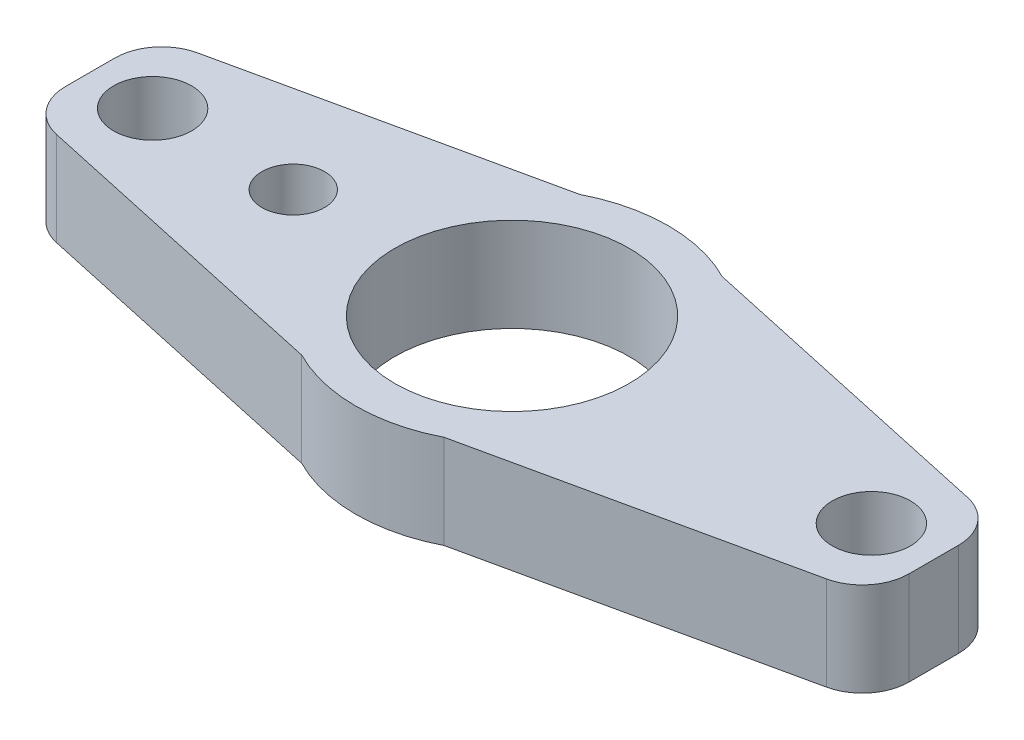
ISO-10303-21;
HEADER;
FILE_DESCRIPTION(('STEP AP214'),'2;1');
FILE_NAME('part.step','',(''),(''),'','','');
FILE_SCHEMA(('AUTOMOTIVE_DESIGN { 1 0 10303 214 1 1 1 1 }'));
ENDSEC;
DATA;
#1=APPLICATION_CONTEXT('core data for automotive mechanical design processes');
#2=APPLICATION_PROTOCOL_DEFINITION('international standard','automotive_design',2000,#1);
#3=PRODUCT_CONTEXT('',#1,'mechanical');
#4=PRODUCT('Part','Part','',(#3));
#5=PRODUCT_RELATED_PRODUCT_CATEGORY('part','',(#4));
#6=PRODUCT_DEFINITION_FORMATION('','',#4);
#7=PRODUCT_DEFINITION_CONTEXT('part definition',#1,'design');
#8=PRODUCT_DEFINITION('design','',#6,#7);
#9=PRODUCT_DEFINITION_SHAPE('','',#8);
#10=(LENGTH_UNIT() NAMED_UNIT(*) SI_UNIT(.MILLI.,.METRE.));
#11=(NAMED_UNIT(*) PLANE_ANGLE_UNIT() SI_UNIT($,.RADIAN.));
#12=(NAMED_UNIT(*) SI_UNIT($,.STERADIAN.) SOLID_ANGLE_UNIT());
#13=UNCERTAINTY_MEASURE_WITH_UNIT(LENGTH_MEASURE(1.E-05),#10,'distance_accuracy_value','');
#14=(GEOMETRIC_REPRESENTATION_CONTEXT(3) GLOBAL_UNCERTAINTY_ASSIGNED_CONTEXT((#13)) GLOBAL_UNIT_ASSIGNED_CONTEXT((#10,
#11,#12)) REPRESENTATION_CONTEXT('',''));
#15=CARTESIAN_POINT('',(0.,0.,0.));
#16=DIRECTION('',(0.,0.,1.));
#17=DIRECTION('',(1.,0.,0.));
#18=AXIS2_PLACEMENT_3D('',#15,#16,#17);
#19=CARTESIAN_POINT('',(0.,3.,0.));
#20=DIRECTION('',(0.,1.,0.));
#21=DIRECTION('',(0.,0.,1.));
#22=AXIS2_PLACEMENT_3D('',#19,#20,#21);
#23=PLANE('',#22);
#24=CARTESIAN_POINT('',(11.5,3.,0.));
#25=DIRECTION('',(0.,1.,0.));
#26=DIRECTION('',(0.,0.,-1.));
#27=AXIS2_PLACEMENT_3D('',#24,#25,#26);
#28=CIRCLE('',#27,1.25);
#29=CARTESIAN_POINT('',(11.5,3.,-1.25));
#30=VERTEX_POINT('',#29);
#31=EDGE_CURVE('E289',#30,#30,#28,.T.);
#32=ORIENTED_EDGE('',*,*,#31,.F.);
#33=EDGE_LOOP('',(#32));
#34=FACE_BOUND('',#33,.T.);
#35=CARTESIAN_POINT('',(0.,3.,0.));
#36=DIRECTION('',(0.,1.,0.));
#37=DIRECTION('',(0.,0.,1.));
#38=AXIS2_PLACEMENT_3D('',#35,#36,#37);
#39=CIRCLE('',#38,3.75);
#40=CARTESIAN_POINT('',(0.,3.,3.75));
#41=VERTEX_POINT('',#40);
#42=EDGE_CURVE('E261',#41,#41,#39,.T.);
#43=ORIENTED_EDGE('',*,*,#42,.F.);
#44=EDGE_LOOP('',(#43));
#45=FACE_BOUND('',#44,.T.);
#46=DIRECTION('',(0.976969831494084,0.,-0.213377478545465));
#47=VECTOR('',#46,1.);
#48=CARTESIAN_POINT('',(2.27784584109344,3.,4.45100194610307));
#49=LINE('',#48,#47);
#50=CARTESIAN_POINT('',(2.27784584109344,3.,4.45100194610307));
#51=VERTEX_POINT('',#50);
#52=CARTESIAN_POINT('',(12.3200662178182,3.,2.25770631515564));
#53=VERTEX_POINT('',#52);
#54=EDGE_CURVE('E129',#51,#53,#49,.T.);
#55=ORIENTED_EDGE('',*,*,#54,.T.);
#56=CARTESIAN_POINT('',(12.,3.,0.792251567914513));
#57=DIRECTION('',(0.,1.,0.));
#58=DIRECTION('',(0.,0.,1.));
#59=AXIS2_PLACEMENT_3D('',#56,#57,#58);
#60=CIRCLE('',#59,1.5);
#61=CARTESIAN_POINT('',(13.5,3.,0.792251567914513));
#62=VERTEX_POINT('',#61);
#63=EDGE_CURVE('E193',#53,#62,#60,.T.);
#64=ORIENTED_EDGE('',*,*,#63,.T.);
#65=DIRECTION('',(0.,0.,-1.));
#66=VECTOR('',#65,1.);
#67=CARTESIAN_POINT('',(13.5,3.,-2.));
#68=LINE('',#67,#66);
#69=CARTESIAN_POINT('',(13.5,3.,-0.792251567914513));
#70=VERTEX_POINT('',#69);
#71=EDGE_CURVE('E140',#62,#70,#68,.T.);
#72=ORIENTED_EDGE('',*,*,#71,.T.);
#73=CARTESIAN_POINT('',(12.,3.,-0.792251567914513));
#74=DIRECTION('',(0.,1.,0.));
#75=DIRECTION('',(0.,0.,1.));
#76=AXIS2_PLACEMENT_3D('',#73,#74,#75);
#77=CIRCLE('',#76,1.5);
#78=CARTESIAN_POINT('',(12.3200662178182,3.,-2.25770631515564));
#79=VERTEX_POINT('',#78);
#80=EDGE_CURVE('E190',#70,#79,#77,.T.);
#81=ORIENTED_EDGE('',*,*,#80,.T.);
#82=DIRECTION('',(-0.976969831494084,0.,-0.213377478545465));
#83=VECTOR('',#82,1.);
#84=CARTESIAN_POINT('',(2.27784584109344,3.,-4.45100194610307));
#85=LINE('',#84,#83);
#86=CARTESIAN_POINT('',(2.27784584109344,3.,-4.45100194610307));
#87=VERTEX_POINT('',#86);
#88=EDGE_CURVE('E271',#79,#87,#85,.T.);
#89=ORIENTED_EDGE('',*,*,#88,.T.);
#90=CARTESIAN_POINT('',(0.,3.,0.));
#91=DIRECTION('',(0.,1.,0.));
#92=DIRECTION('',(0.,0.,1.));
#93=AXIS2_PLACEMENT_3D('',#90,#91,#92);
#94=CIRCLE('',#93,5.);
#95=CARTESIAN_POINT('',(-2.27784584109346,3.,-4.45100194610306));
#96=VERTEX_POINT('',#95);
#97=EDGE_CURVE('E268',#87,#96,#94,.T.);
#98=ORIENTED_EDGE('',*,*,#97,.T.);
#99=DIRECTION('',(-0.976969831494084,0.,0.213377478545465));
#100=VECTOR('',#99,1.);
#101=CARTESIAN_POINT('',(-2.27784584109346,3.,-4.45100194610306));
#102=LINE('',#101,#100);
#103=CARTESIAN_POINT('',(-12.3200662178182,3.,-2.25770631515564));
#104=VERTEX_POINT('',#103);
#105=EDGE_CURVE('E242',#96,#104,#102,.T.);
#106=ORIENTED_EDGE('',*,*,#105,.T.);
#107=CARTESIAN_POINT('',(-12.,3.,-0.792251567914513));
#108=DIRECTION('',(0.,1.,0.));
#109=DIRECTION('',(0.,0.,1.));
#110=AXIS2_PLACEMENT_3D('',#107,#108,#109);
#111=CIRCLE('',#110,1.5);
#112=CARTESIAN_POINT('',(-13.5,3.,-0.792251567914513));
#113=VERTEX_POINT('',#112);
#114=EDGE_CURVE('E185',#104,#113,#111,.T.);
#115=ORIENTED_EDGE('',*,*,#114,.T.);
#116=DIRECTION('',(0.,0.,1.));
#117=VECTOR('',#116,1.);
#118=CARTESIAN_POINT('',(-13.5,3.,-2.));
#119=LINE('',#118,#117);
#120=CARTESIAN_POINT('',(-13.5,3.,0.792251567914513));
#121=VERTEX_POINT('',#120);
#122=EDGE_CURVE('E212',#113,#121,#119,.T.);
#123=ORIENTED_EDGE('',*,*,#122,.T.);
#124=CARTESIAN_POINT('',(-12.,3.,0.792251567914513));
#125=DIRECTION('',(0.,1.,0.));
#126=DIRECTION('',(0.,0.,1.));
#127=AXIS2_PLACEMENT_3D('',#124,#125,#126);
#128=CIRCLE('',#127,1.5);
#129=CARTESIAN_POINT('',(-12.3200662178182,3.,2.25770631515564));
#130=VERTEX_POINT('',#129);
#131=EDGE_CURVE('E55',#121,#130,#128,.T.);
#132=ORIENTED_EDGE('',*,*,#131,.T.);
#133=DIRECTION('',(0.976969831494084,0.,0.213377478545465));
#134=VECTOR('',#133,1.);
#135=CARTESIAN_POINT('',(-2.27784584109346,3.,4.45100194610306));
#136=LINE('',#135,#134);
#137=CARTESIAN_POINT('',(-2.27784584109346,3.,4.45100194610306));
#138=VERTEX_POINT('',#137);
#139=EDGE_CURVE('E145',#130,#138,#136,.T.);
#140=ORIENTED_EDGE('',*,*,#139,.T.);
#141=CARTESIAN_POINT('',(0.,3.,0.));
#142=DIRECTION('',(0.,1.,0.));
#143=DIRECTION('',(0.,0.,1.));
#144=AXIS2_PLACEMENT_3D('',#141,#142,#143);
#145=CIRCLE('',#144,5.);
#146=EDGE_CURVE('E141',#138,#51,#145,.T.);
#147=ORIENTED_EDGE('',*,*,#146,.T.);
#148=EDGE_LOOP('',(#55,#64,#72,#81,#89,#98,#106,#115,#123,#132,#140,#147));
#149=FACE_BOUND('',#148,.T.);
#150=CARTESIAN_POINT('',(-11.5,3.,0.));
#151=DIRECTION('',(0.,1.,0.));
#152=DIRECTION('',(0.,0.,1.));
#153=AXIS2_PLACEMENT_3D('',#150,#151,#152);
#154=CIRCLE('',#153,1.25);
#155=CARTESIAN_POINT('',(-11.5,3.,1.25));
#156=VERTEX_POINT('',#155);
#157=EDGE_CURVE('E281',#156,#156,#154,.T.);
#158=ORIENTED_EDGE('',*,*,#157,.F.);
#159=EDGE_LOOP('',(#158));
#160=FACE_BOUND('',#159,.T.);
#161=CARTESIAN_POINT('',(-7.,3.,0.));
#162=DIRECTION('',(0.,1.,0.));
#163=DIRECTION('',(0.,0.,1.));
#164=AXIS2_PLACEMENT_3D('',#161,#162,#163);
#165=CIRCLE('',#164,1.);
#166=CARTESIAN_POINT('',(-7.,3.,1.));
#167=VERTEX_POINT('',#166);
#168=EDGE_CURVE('E297',#167,#167,#165,.T.);
#169=ORIENTED_EDGE('',*,*,#168,.F.);
#170=EDGE_LOOP('',(#169));
#171=FACE_BOUND('',#170,.T.);
#172=ADVANCED_FACE('F39',(#34,#45,#149,#160,#171),#23,.T.);
#173=CARTESIAN_POINT('',(0.,0.,0.));
#174=DIRECTION('',(0.,1.,0.));
#175=DIRECTION('',(0.,0.,1.));
#176=AXIS2_PLACEMENT_3D('',#173,#174,#175);
#177=PLANE('',#176);
#178=DIRECTION('',(0.,0.,-1.));
#179=VECTOR('',#178,1.);
#180=CARTESIAN_POINT('',(13.5,0.,-2.));
#181=LINE('',#180,#179);
#182=CARTESIAN_POINT('',(13.5,0.,0.792251567914513));
#183=VERTEX_POINT('',#182);
#184=CARTESIAN_POINT('',(13.5,0.,-0.792251567914513));
#185=VERTEX_POINT('',#184);
#186=EDGE_CURVE('E250',#183,#185,#181,.T.);
#187=ORIENTED_EDGE('',*,*,#186,.F.);
#188=CARTESIAN_POINT('',(12.,0.,0.792251567914513));
#189=DIRECTION('',(0.,1.,0.));
#190=DIRECTION('',(0.,0.,1.));
#191=AXIS2_PLACEMENT_3D('',#188,#189,#190);
#192=CIRCLE('',#191,1.5);
#193=CARTESIAN_POINT('',(12.3200662178182,0.,2.25770631515564));
#194=VERTEX_POINT('',#193);
#195=EDGE_CURVE('E180',#183,#194,#192,.F.);
#196=ORIENTED_EDGE('',*,*,#195,.T.);
#197=DIRECTION('',(0.976969831494084,0.,-0.213377478545465));
#198=VECTOR('',#197,1.);
#199=CARTESIAN_POINT('',(2.27784584109344,0.,4.45100194610307));
#200=LINE('',#199,#198);
#201=CARTESIAN_POINT('',(2.27784584109344,0.,4.45100194610307));
#202=VERTEX_POINT('',#201);
#203=EDGE_CURVE('E256',#202,#194,#200,.T.);
#204=ORIENTED_EDGE('',*,*,#203,.F.);
#205=CARTESIAN_POINT('',(0.,0.,0.));
#206=DIRECTION('',(0.,1.,0.));
#207=DIRECTION('',(0.,0.,1.));
#208=AXIS2_PLACEMENT_3D('',#205,#206,#207);
#209=CIRCLE('',#208,5.);
#210=CARTESIAN_POINT('',(-2.27784584109346,0.,4.45100194610306));
#211=VERTEX_POINT('',#210);
#212=EDGE_CURVE('E154',#211,#202,#209,.T.);
#213=ORIENTED_EDGE('',*,*,#212,.F.);
#214=DIRECTION('',(0.976969831494084,0.,0.213377478545465));
#215=VECTOR('',#214,1.);
#216=CARTESIAN_POINT('',(-2.27784584109346,0.,4.45100194610306));
#217=LINE('',#216,#215);
#218=CARTESIAN_POINT('',(-12.3200662178182,0.,2.25770631515564));
#219=VERTEX_POINT('',#218);
#220=EDGE_CURVE('E150',#219,#211,#217,.T.);
#221=ORIENTED_EDGE('',*,*,#220,.F.);
#222=CARTESIAN_POINT('',(-12.,0.,0.792251567914513));
#223=DIRECTION('',(0.,1.,0.));
#224=DIRECTION('',(0.,0.,1.));
#225=AXIS2_PLACEMENT_3D('',#222,#223,#224);
#226=CIRCLE('',#225,1.5);
#227=CARTESIAN_POINT('',(-13.5,0.,0.792251567914513));
#228=VERTEX_POINT('',#227);
#229=EDGE_CURVE('E174',#219,#228,#226,.F.);
#230=ORIENTED_EDGE('',*,*,#229,.T.);
#231=DIRECTION('',(0.,0.,1.));
#232=VECTOR('',#231,1.);
#233=CARTESIAN_POINT('',(-13.5,0.,-2.));
#234=LINE('',#233,#232);
#235=CARTESIAN_POINT('',(-13.5,0.,-0.792251567914513));
#236=VERTEX_POINT('',#235);
#237=EDGE_CURVE('E211',#236,#228,#234,.T.);
#238=ORIENTED_EDGE('',*,*,#237,.F.);
#239=CARTESIAN_POINT('',(-12.,0.,-0.792251567914513));
#240=DIRECTION('',(0.,1.,0.));
#241=DIRECTION('',(0.,0.,1.));
#242=AXIS2_PLACEMENT_3D('',#239,#240,#241);
#243=CIRCLE('',#242,1.5);
#244=CARTESIAN_POINT('',(-12.3200662178182,0.,-2.25770631515564));
#245=VERTEX_POINT('',#244);
#246=EDGE_CURVE('E171',#236,#245,#243,.F.);
#247=ORIENTED_EDGE('',*,*,#246,.T.);
#248=DIRECTION('',(-0.976969831494084,0.,0.213377478545465));
#249=VECTOR('',#248,1.);
#250=CARTESIAN_POINT('',(-2.27784584109346,0.,-4.45100194610306));
#251=LINE('',#250,#249);
#252=CARTESIAN_POINT('',(-2.27784584109346,0.,-4.45100194610306));
#253=VERTEX_POINT('',#252);
#254=EDGE_CURVE('E223',#253,#245,#251,.T.);
#255=ORIENTED_EDGE('',*,*,#254,.F.);
#256=CARTESIAN_POINT('',(0.,0.,0.));
#257=DIRECTION('',(0.,1.,0.));
#258=DIRECTION('',(0.,0.,1.));
#259=AXIS2_PLACEMENT_3D('',#256,#257,#258);
#260=CIRCLE('',#259,5.);
#261=CARTESIAN_POINT('',(2.27784584109344,0.,-4.45100194610307));
#262=VERTEX_POINT('',#261);
#263=EDGE_CURVE('E228',#262,#253,#260,.T.);
#264=ORIENTED_EDGE('',*,*,#263,.F.);
#265=DIRECTION('',(-0.976969831494084,0.,-0.213377478545465));
#266=VECTOR('',#265,1.);
#267=CARTESIAN_POINT('',(2.27784584109344,0.,-4.45100194610307));
#268=LINE('',#267,#266);
#269=CARTESIAN_POINT('',(12.3200662178182,0.,-2.25770631515564));
#270=VERTEX_POINT('',#269);
#271=EDGE_CURVE('E247',#270,#262,#268,.T.);
#272=ORIENTED_EDGE('',*,*,#271,.F.);
#273=CARTESIAN_POINT('',(12.,0.,-0.792251567914513));
#274=DIRECTION('',(0.,1.,0.));
#275=DIRECTION('',(0.,0.,1.));
#276=AXIS2_PLACEMENT_3D('',#273,#274,#275);
#277=CIRCLE('',#276,1.5);
#278=EDGE_CURVE('E177',#270,#185,#277,.F.);
#279=ORIENTED_EDGE('',*,*,#278,.T.);
#280=EDGE_LOOP('',(#187,#196,#204,#213,#221,#230,#238,#247,#255,#264,#272,#279));
#281=FACE_BOUND('',#280,.T.);
#282=CARTESIAN_POINT('',(0.,0.,0.));
#283=DIRECTION('',(0.,1.,0.));
#284=DIRECTION('',(0.,0.,1.));
#285=AXIS2_PLACEMENT_3D('',#282,#283,#284);
#286=CIRCLE('',#285,3.75);
#287=CARTESIAN_POINT('',(0.,0.,3.75));
#288=VERTEX_POINT('',#287);
#289=EDGE_CURVE('E277',#288,#288,#286,.T.);
#290=ORIENTED_EDGE('',*,*,#289,.T.);
#291=EDGE_LOOP('',(#290));
#292=FACE_BOUND('',#291,.T.);
#293=CARTESIAN_POINT('',(-11.5,0.,0.));
#294=DIRECTION('',(0.,1.,0.));
#295=DIRECTION('',(0.,0.,1.));
#296=AXIS2_PLACEMENT_3D('',#293,#294,#295);
#297=CIRCLE('',#296,1.25);
#298=CARTESIAN_POINT('',(-11.5,0.,1.25));
#299=VERTEX_POINT('',#298);
#300=EDGE_CURVE('E285',#299,#299,#297,.T.);
#301=ORIENTED_EDGE('',*,*,#300,.T.);
#302=EDGE_LOOP('',(#301));
#303=FACE_BOUND('',#302,.T.);
#304=CARTESIAN_POINT('',(11.5,0.,0.));
#305=DIRECTION('',(0.,1.,0.));
#306=DIRECTION('',(0.,0.,-1.));
#307=AXIS2_PLACEMENT_3D('',#304,#305,#306);
#308=CIRCLE('',#307,1.25);
#309=CARTESIAN_POINT('',(11.5,0.,-1.25));
#310=VERTEX_POINT('',#309);
#311=EDGE_CURVE('E293',#310,#310,#308,.T.);
#312=ORIENTED_EDGE('',*,*,#311,.T.);
#313=EDGE_LOOP('',(#312));
#314=FACE_BOUND('',#313,.T.);
#315=CARTESIAN_POINT('',(-7.,0.,0.));
#316=DIRECTION('',(0.,1.,0.));
#317=DIRECTION('',(0.,0.,1.));
#318=AXIS2_PLACEMENT_3D('',#315,#316,#317);
#319=CIRCLE('',#318,1.);
#320=CARTESIAN_POINT('',(-7.,0.,1.));
#321=VERTEX_POINT('',#320);
#322=EDGE_CURVE('E301',#321,#321,#319,.T.);
#323=ORIENTED_EDGE('',*,*,#322,.T.);
#324=EDGE_LOOP('',(#323));
#325=FACE_BOUND('',#324,.T.);
#326=ADVANCED_FACE('F217',(#281,#292,#303,#314,#325),#177,.F.);
#327=CARTESIAN_POINT('',(0.,3.,0.));
#328=DIRECTION('',(0.,-1.,0.));
#329=DIRECTION('',(0.,0.,-1.));
#330=AXIS2_PLACEMENT_3D('',#327,#328,#329);
#331=CYLINDRICAL_SURFACE('',#330,5.);
#332=ORIENTED_EDGE('',*,*,#212,.T.);
#333=DIRECTION('',(0.,-1.,0.));
#334=VECTOR('',#333,1.);
#335=CARTESIAN_POINT('',(2.27784584109344,3.,4.45100194610307));
#336=LINE('',#335,#334);
#337=EDGE_CURVE('E134',#51,#202,#336,.T.);
#338=ORIENTED_EDGE('',*,*,#337,.F.);
#339=ORIENTED_EDGE('',*,*,#146,.F.);
#340=DIRECTION('',(0.,-1.,0.));
#341=VECTOR('',#340,1.);
#342=CARTESIAN_POINT('',(-2.27784584109346,3.,4.45100194610306));
#343=LINE('',#342,#341);
#344=EDGE_CURVE('E232',#138,#211,#343,.T.);
#345=ORIENTED_EDGE('',*,*,#344,.T.);
#346=EDGE_LOOP('',(#332,#338,#339,#345));
#347=FACE_BOUND('',#346,.T.);
#348=ADVANCED_FACE('F152',(#347),#331,.T.);
#349=CARTESIAN_POINT('',(2.27784584109344,3.,4.45100194610307));
#350=DIRECTION('',(-0.213377478545465,0.,-0.976969831494084));
#351=DIRECTION('',(-0.976969831494084,0.,0.213377478545465));
#352=AXIS2_PLACEMENT_3D('',#349,#350,#351);
#353=PLANE('',#352);
#354=ORIENTED_EDGE('',*,*,#203,.T.);
#355=DIRECTION('',(0.,-1.,0.));
#356=VECTOR('',#355,1.);
#357=CARTESIAN_POINT('',(12.3200662178182,3.,2.25770631515564));
#358=LINE('',#357,#356);
#359=EDGE_CURVE('E137',#194,#53,#358,.F.);
#360=ORIENTED_EDGE('',*,*,#359,.T.);
#361=ORIENTED_EDGE('',*,*,#54,.F.);
#362=ORIENTED_EDGE('',*,*,#337,.T.);
#363=EDGE_LOOP('',(#354,#360,#361,#362));
#364=FACE_BOUND('',#363,.T.);
#365=ADVANCED_FACE('F132',(#364),#353,.F.);
#366=CARTESIAN_POINT('',(13.5,3.,-2.));
#367=DIRECTION('',(-1.,0.,0.));
#368=DIRECTION('',(0.,0.,1.));
#369=AXIS2_PLACEMENT_3D('',#366,#367,#368);
#370=PLANE('',#369);
#371=ORIENTED_EDGE('',*,*,#71,.F.);
#372=DIRECTION('',(0.,-1.,0.));
#373=VECTOR('',#372,1.);
#374=CARTESIAN_POINT('',(13.5,3.,0.792251567914513));
#375=LINE('',#374,#373);
#376=EDGE_CURVE('E161',#62,#183,#375,.T.);
#377=ORIENTED_EDGE('',*,*,#376,.T.);
#378=ORIENTED_EDGE('',*,*,#186,.T.);
#379=DIRECTION('',(0.,-1.,0.));
#380=VECTOR('',#379,1.);
#381=CARTESIAN_POINT('',(13.5,3.,-0.792251567914513));
#382=LINE('',#381,#380);
#383=EDGE_CURVE('E156',#185,#70,#382,.F.);
#384=ORIENTED_EDGE('',*,*,#383,.T.);
#385=EDGE_LOOP('',(#371,#377,#378,#384));
#386=FACE_BOUND('',#385,.T.);
#387=ADVANCED_FACE('F339',(#386),#370,.F.);
#388=CARTESIAN_POINT('',(2.27784584109344,3.,-4.45100194610307));
#389=DIRECTION('',(-0.213377478545465,0.,0.976969831494084));
#390=DIRECTION('',(0.976969831494085,0.,0.213377478545465));
#391=AXIS2_PLACEMENT_3D('',#388,#389,#390);
#392=PLANE('',#391);
#393=ORIENTED_EDGE('',*,*,#88,.F.);
#394=DIRECTION('',(0.,-1.,0.));
#395=VECTOR('',#394,1.);
#396=CARTESIAN_POINT('',(12.3200662178182,3.,-2.25770631515564));
#397=LINE('',#396,#395);
#398=EDGE_CURVE('E196',#79,#270,#397,.T.);
#399=ORIENTED_EDGE('',*,*,#398,.T.);
#400=ORIENTED_EDGE('',*,*,#271,.T.);
#401=DIRECTION('',(0.,-1.,0.));
#402=VECTOR('',#401,1.);
#403=CARTESIAN_POINT('',(2.27784584109344,3.,-4.45100194610307));
#404=LINE('',#403,#402);
#405=EDGE_CURVE('E157',#87,#262,#404,.T.);
#406=ORIENTED_EDGE('',*,*,#405,.F.);
#407=EDGE_LOOP('',(#393,#399,#400,#406));
#408=FACE_BOUND('',#407,.T.);
#409=ADVANCED_FACE('F336',(#408),#392,.F.);
#410=CARTESIAN_POINT('',(0.,3.,0.));
#411=DIRECTION('',(0.,-1.,0.));
#412=DIRECTION('',(0.,0.,-1.));
#413=AXIS2_PLACEMENT_3D('',#410,#411,#412);
#414=CYLINDRICAL_SURFACE('',#413,5.);
#415=ORIENTED_EDGE('',*,*,#263,.T.);
#416=DIRECTION('',(0.,-1.,0.));
#417=VECTOR('',#416,1.);
#418=CARTESIAN_POINT('',(-2.27784584109346,3.,-4.45100194610306));
#419=LINE('',#418,#417);
#420=EDGE_CURVE('E164',#96,#253,#419,.T.);
#421=ORIENTED_EDGE('',*,*,#420,.F.);
#422=ORIENTED_EDGE('',*,*,#97,.F.);
#423=ORIENTED_EDGE('',*,*,#405,.T.);
#424=EDGE_LOOP('',(#415,#421,#422,#423));
#425=FACE_BOUND('',#424,.T.);
#426=ADVANCED_FACE('F333',(#425),#414,.T.);
#427=CARTESIAN_POINT('',(-2.27784584109346,3.,-4.45100194610306));
#428=DIRECTION('',(0.213377478545465,0.,0.976969831494084));
#429=DIRECTION('',(0.976969831494085,0.,-0.213377478545465));
#430=AXIS2_PLACEMENT_3D('',#427,#428,#429);
#431=PLANE('',#430);
#432=ORIENTED_EDGE('',*,*,#254,.T.);
#433=DIRECTION('',(0.,-1.,0.));
#434=VECTOR('',#433,1.);
#435=CARTESIAN_POINT('',(-12.3200662178182,3.,-2.25770631515564));
#436=LINE('',#435,#434);
#437=EDGE_CURVE('E11',#245,#104,#436,.F.);
#438=ORIENTED_EDGE('',*,*,#437,.T.);
#439=ORIENTED_EDGE('',*,*,#105,.F.);
#440=ORIENTED_EDGE('',*,*,#420,.T.);
#441=EDGE_LOOP('',(#432,#438,#439,#440));
#442=FACE_BOUND('',#441,.T.);
#443=ADVANCED_FACE('F239',(#442),#431,.F.);
#444=CARTESIAN_POINT('',(-13.5,3.,-2.));
#445=DIRECTION('',(1.,0.,0.));
#446=DIRECTION('',(0.,0.,-1.));
#447=AXIS2_PLACEMENT_3D('',#444,#445,#446);
#448=PLANE('',#447);
#449=ORIENTED_EDGE('',*,*,#237,.T.);
#450=DIRECTION('',(0.,-1.,0.));
#451=VECTOR('',#450,1.);
#452=CARTESIAN_POINT('',(-13.5,3.,0.792251567914513));
#453=LINE('',#452,#451);
#454=EDGE_CURVE('E48',#228,#121,#453,.F.);
#455=ORIENTED_EDGE('',*,*,#454,.T.);
#456=ORIENTED_EDGE('',*,*,#122,.F.);
#457=DIRECTION('',(0.,-1.,0.));
#458=VECTOR('',#457,1.);
#459=CARTESIAN_POINT('',(-13.5,3.,-0.792251567914513));
#460=LINE('',#459,#458);
#461=EDGE_CURVE('E204',#113,#236,#460,.T.);
#462=ORIENTED_EDGE('',*,*,#461,.T.);
#463=EDGE_LOOP('',(#449,#455,#456,#462));
#464=FACE_BOUND('',#463,.T.);
#465=ADVANCED_FACE('F210',(#464),#448,.F.);
#466=CARTESIAN_POINT('',(-2.27784584109346,3.,4.45100194610306));
#467=DIRECTION('',(0.213377478545465,0.,-0.976969831494084));
#468=DIRECTION('',(-0.976969831494085,0.,-0.213377478545465));
#469=AXIS2_PLACEMENT_3D('',#466,#467,#468);
#470=PLANE('',#469);
#471=ORIENTED_EDGE('',*,*,#139,.F.);
#472=DIRECTION('',(0.,-1.,0.));
#473=VECTOR('',#472,1.);
#474=CARTESIAN_POINT('',(-12.3200662178182,3.,2.25770631515564));
#475=LINE('',#474,#473);
#476=EDGE_CURVE('E200',#130,#219,#475,.T.);
#477=ORIENTED_EDGE('',*,*,#476,.T.);
#478=ORIENTED_EDGE('',*,*,#220,.T.);
#479=ORIENTED_EDGE('',*,*,#344,.F.);
#480=EDGE_LOOP('',(#471,#477,#478,#479));
#481=FACE_BOUND('',#480,.T.);
#482=ADVANCED_FACE('F325',(#481),#470,.F.);
#483=CARTESIAN_POINT('',(0.,3.,0.));
#484=DIRECTION('',(0.,-1.,0.));
#485=DIRECTION('',(0.,0.,-1.));
#486=AXIS2_PLACEMENT_3D('',#483,#484,#485);
#487=CYLINDRICAL_SURFACE('',#486,3.75);
#488=ORIENTED_EDGE('',*,*,#42,.T.);
#489=EDGE_LOOP('',(#488));
#490=FACE_BOUND('',#489,.T.);
#491=ORIENTED_EDGE('',*,*,#289,.F.);
#492=EDGE_LOOP('',(#491));
#493=FACE_BOUND('',#492,.T.);
#494=ADVANCED_FACE('F322',(#490,#493),#487,.F.);
#495=CARTESIAN_POINT('',(-11.5,3.,0.));
#496=DIRECTION('',(0.,-1.,0.));
#497=DIRECTION('',(0.,0.,-1.));
#498=AXIS2_PLACEMENT_3D('',#495,#496,#497);
#499=CYLINDRICAL_SURFACE('',#498,1.25);
#500=ORIENTED_EDGE('',*,*,#157,.T.);
#501=EDGE_LOOP('',(#500));
#502=FACE_BOUND('',#501,.T.);
#503=ORIENTED_EDGE('',*,*,#300,.F.);
#504=EDGE_LOOP('',(#503));
#505=FACE_BOUND('',#504,.T.);
#506=ADVANCED_FACE('F455',(#502,#505),#499,.F.);
#507=CARTESIAN_POINT('',(11.5,3.,0.));
#508=DIRECTION('',(0.,-1.,0.));
#509=DIRECTION('',(0.,0.,-1.));
#510=AXIS2_PLACEMENT_3D('',#507,#508,#509);
#511=CYLINDRICAL_SURFACE('',#510,1.25);
#512=ORIENTED_EDGE('',*,*,#31,.T.);
#513=EDGE_LOOP('',(#512));
#514=FACE_BOUND('',#513,.T.);
#515=ORIENTED_EDGE('',*,*,#311,.F.);
#516=EDGE_LOOP('',(#515));
#517=FACE_BOUND('',#516,.T.);
#518=ADVANCED_FACE('F446',(#514,#517),#511,.F.);
#519=CARTESIAN_POINT('',(-7.,3.,0.));
#520=DIRECTION('',(0.,-1.,0.));
#521=DIRECTION('',(0.,0.,-1.));
#522=AXIS2_PLACEMENT_3D('',#519,#520,#521);
#523=CYLINDRICAL_SURFACE('',#522,1.);
#524=ORIENTED_EDGE('',*,*,#168,.T.);
#525=EDGE_LOOP('',(#524));
#526=FACE_BOUND('',#525,.T.);
#527=ORIENTED_EDGE('',*,*,#322,.F.);
#528=EDGE_LOOP('',(#527));
#529=FACE_BOUND('',#528,.T.);
#530=ADVANCED_FACE('F309',(#526,#529),#523,.F.);
#531=CARTESIAN_POINT('',(12.,3.,0.792251567914513));
#532=DIRECTION('',(0.,-1.,0.));
#533=DIRECTION('',(0.,0.,-1.));
#534=AXIS2_PLACEMENT_3D('',#531,#532,#533);
#535=CYLINDRICAL_SURFACE('',#534,1.5);
#536=ORIENTED_EDGE('',*,*,#63,.F.);
#537=ORIENTED_EDGE('',*,*,#359,.F.);
#538=ORIENTED_EDGE('',*,*,#195,.F.);
#539=ORIENTED_EDGE('',*,*,#376,.F.);
#540=EDGE_LOOP('',(#536,#537,#538,#539));
#541=FACE_BOUND('',#540,.T.);
#542=ADVANCED_FACE('F348',(#541),#535,.T.);
#543=CARTESIAN_POINT('',(12.,3.,-0.792251567914513));
#544=DIRECTION('',(0.,-1.,0.));
#545=DIRECTION('',(0.,0.,-1.));
#546=AXIS2_PLACEMENT_3D('',#543,#544,#545);
#547=CYLINDRICAL_SURFACE('',#546,1.5);
#548=ORIENTED_EDGE('',*,*,#80,.F.);
#549=ORIENTED_EDGE('',*,*,#383,.F.);
#550=ORIENTED_EDGE('',*,*,#278,.F.);
#551=ORIENTED_EDGE('',*,*,#398,.F.);
#552=EDGE_LOOP('',(#548,#549,#550,#551));
#553=FACE_BOUND('',#552,.T.);
#554=ADVANCED_FACE('F351',(#553),#547,.T.);
#555=CARTESIAN_POINT('',(-12.,3.,0.792251567914513));
#556=DIRECTION('',(0.,-1.,0.));
#557=DIRECTION('',(0.,0.,-1.));
#558=AXIS2_PLACEMENT_3D('',#555,#556,#557);
#559=CYLINDRICAL_SURFACE('',#558,1.5);
#560=ORIENTED_EDGE('',*,*,#131,.F.);
#561=ORIENTED_EDGE('',*,*,#454,.F.);
#562=ORIENTED_EDGE('',*,*,#229,.F.);
#563=ORIENTED_EDGE('',*,*,#476,.F.);
#564=EDGE_LOOP('',(#560,#561,#562,#563));
#565=FACE_BOUND('',#564,.T.);
#566=ADVANCED_FACE('F354',(#565),#559,.T.);
#567=CARTESIAN_POINT('',(-12.,3.,-0.792251567914513));
#568=DIRECTION('',(0.,-1.,0.));
#569=DIRECTION('',(0.,0.,-1.));
#570=AXIS2_PLACEMENT_3D('',#567,#568,#569);
#571=CYLINDRICAL_SURFACE('',#570,1.5);
#572=ORIENTED_EDGE('',*,*,#114,.F.);
#573=ORIENTED_EDGE('',*,*,#437,.F.);
#574=ORIENTED_EDGE('',*,*,#246,.F.);
#575=ORIENTED_EDGE('',*,*,#461,.F.);
#576=EDGE_LOOP('',(#572,#573,#574,#575));
#577=FACE_BOUND('',#576,.T.);
#578=ADVANCED_FACE('F41',(#577),#571,.T.);
#579=CLOSED_SHELL('',(#172,#326,#348,#365,#387,#409,#426,#443,#465,#482,#494,#506,#518,#530,
#542,#554,#566,#578));
#580=MANIFOLD_SOLID_BREP('B2',#579);
#581=ADVANCED_BREP_SHAPE_REPRESENTATION('',(#18,#580),#14);
#582=SHAPE_DEFINITION_REPRESENTATION(#9,#581);
ENDSEC;
END-ISO-10303-21;
